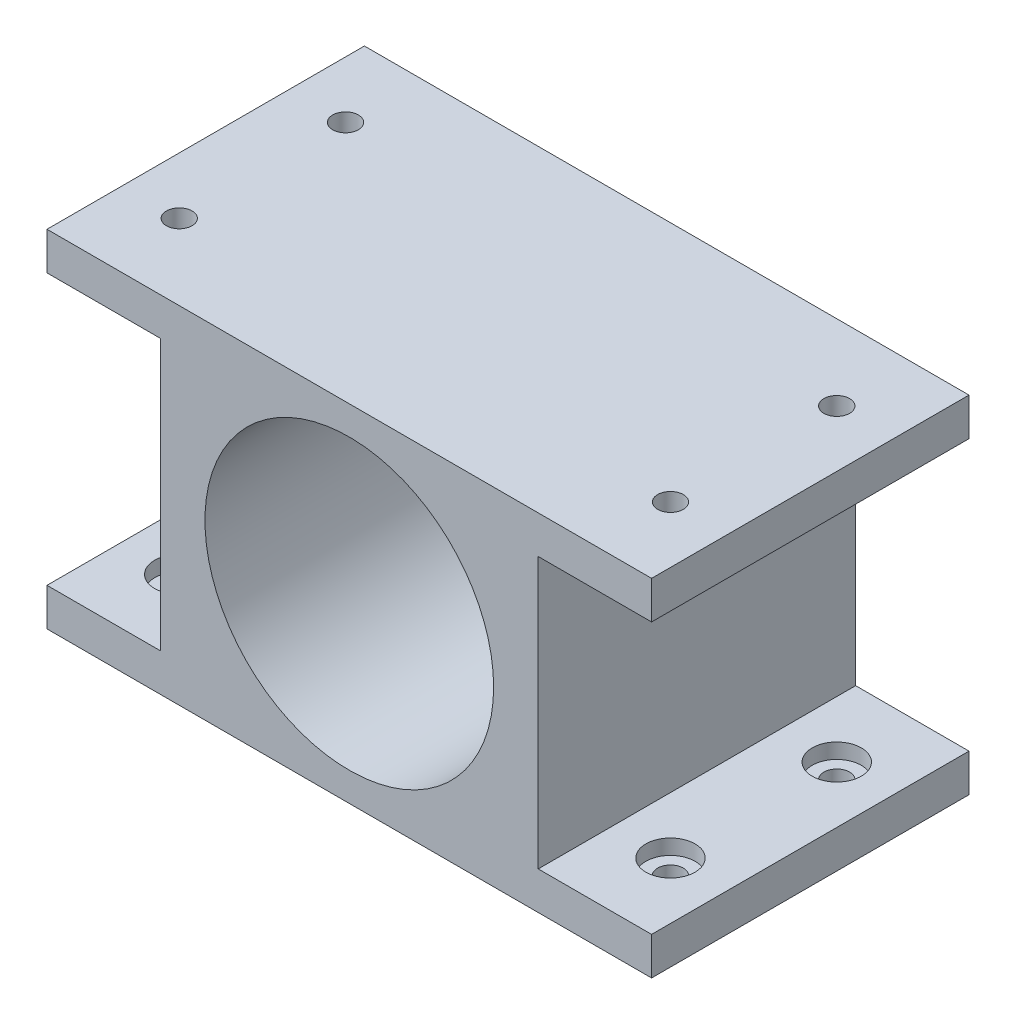
ISO-10303-21;
HEADER;
FILE_DESCRIPTION(('STEP AP214'),'2;1');
FILE_NAME('part.step','',(''),(''),'','','');
FILE_SCHEMA(('AUTOMOTIVE_DESIGN { 1 0 10303 214 1 1 1 1 }'));
ENDSEC;
DATA;
#1=APPLICATION_CONTEXT('core data for automotive mechanical design processes');
#2=APPLICATION_PROTOCOL_DEFINITION('international standard','automotive_design',2000,#1);
#3=PRODUCT_CONTEXT('',#1,'mechanical');
#4=PRODUCT('Part','Part','',(#3));
#5=PRODUCT_RELATED_PRODUCT_CATEGORY('part','',(#4));
#6=PRODUCT_DEFINITION_FORMATION('','',#4);
#7=PRODUCT_DEFINITION_CONTEXT('part definition',#1,'design');
#8=PRODUCT_DEFINITION('design','',#6,#7);
#9=PRODUCT_DEFINITION_SHAPE('','',#8);
#10=(LENGTH_UNIT() NAMED_UNIT(*) SI_UNIT(.MILLI.,.METRE.));
#11=(NAMED_UNIT(*) PLANE_ANGLE_UNIT() SI_UNIT($,.RADIAN.));
#12=(NAMED_UNIT(*) SI_UNIT($,.STERADIAN.) SOLID_ANGLE_UNIT());
#13=UNCERTAINTY_MEASURE_WITH_UNIT(LENGTH_MEASURE(1.E-05),#10,'distance_accuracy_value','');
#14=(GEOMETRIC_REPRESENTATION_CONTEXT(3) GLOBAL_UNCERTAINTY_ASSIGNED_CONTEXT((#13)) GLOBAL_UNIT_ASSIGNED_CONTEXT((#10,
#11,#12)) REPRESENTATION_CONTEXT('',''));
#15=CARTESIAN_POINT('',(0.,0.,0.));
#16=DIRECTION('',(0.,0.,1.));
#17=DIRECTION('',(1.,0.,0.));
#18=AXIS2_PLACEMENT_3D('',#15,#16,#17);
#19=CARTESIAN_POINT('',(0.,0.,2.));
#20=DIRECTION('',(0.,0.,1.));
#21=DIRECTION('',(1.,0.,0.));
#22=AXIS2_PLACEMENT_3D('',#19,#20,#21);
#23=PLANE('',#22);
#24=CARTESIAN_POINT('',(25.,38.1,2.));
#25=DIRECTION('',(0.,0.,1.));
#26=DIRECTION('',(1.,0.,0.));
#27=AXIS2_PLACEMENT_3D('',#24,#25,#26);
#28=CIRCLE('',#27,2.);
#29=CARTESIAN_POINT('',(27.,38.1,2.));
#30=VERTEX_POINT('',#29);
#31=EDGE_CURVE('E199',#30,#30,#28,.T.);
#32=ORIENTED_EDGE('',*,*,#31,.F.);
#33=EDGE_LOOP('',(#32));
#34=FACE_BOUND('',#33,.T.);
#35=CARTESIAN_POINT('',(38.1635861375235,15.3,2.));
#36=DIRECTION('',(0.,0.,1.));
#37=DIRECTION('',(1.,0.,0.));
#38=AXIS2_PLACEMENT_3D('',#35,#36,#37);
#39=CIRCLE('',#38,2.);
#40=CARTESIAN_POINT('',(40.1635861375235,15.3,2.));
#41=VERTEX_POINT('',#40);
#42=EDGE_CURVE('E196',#41,#41,#39,.T.);
#43=ORIENTED_EDGE('',*,*,#42,.F.);
#44=EDGE_LOOP('',(#43));
#45=FACE_BOUND('',#44,.T.);
#46=CARTESIAN_POINT('',(11.8364138624766,15.2999999999999,2.));
#47=DIRECTION('',(0.,0.,1.));
#48=DIRECTION('',(1.,0.,0.));
#49=AXIS2_PLACEMENT_3D('',#46,#47,#48);
#50=CIRCLE('',#49,2.);
#51=CARTESIAN_POINT('',(13.8364138624766,15.2999999999999,2.));
#52=VERTEX_POINT('',#51);
#53=EDGE_CURVE('E192',#52,#52,#50,.T.);
#54=ORIENTED_EDGE('',*,*,#53,.F.);
#55=EDGE_LOOP('',(#54));
#56=FACE_BOUND('',#55,.T.);
#57=CARTESIAN_POINT('',(25.,22.9,2.));
#58=DIRECTION('',(0.,0.,1.));
#59=DIRECTION('',(1.,0.,0.));
#60=AXIS2_PLACEMENT_3D('',#57,#58,#59);
#61=CIRCLE('',#60,11.);
#62=CARTESIAN_POINT('',(36.,22.9,2.));
#63=VERTEX_POINT('',#62);
#64=EDGE_CURVE('E189',#63,#63,#61,.T.);
#65=ORIENTED_EDGE('',*,*,#64,.F.);
#66=EDGE_LOOP('',(#65));
#67=FACE_BOUND('',#66,.T.);
#68=CARTESIAN_POINT('',(25.,22.9,2.));
#69=DIRECTION('',(0.,0.,1.));
#70=DIRECTION('',(1.,0.,0.));
#71=AXIS2_PLACEMENT_3D('',#68,#69,#70);
#72=CIRCLE('',#71,19.1);
#73=CARTESIAN_POINT('',(44.1,22.9,2.));
#74=VERTEX_POINT('',#73);
#75=EDGE_CURVE('E11',#74,#74,#72,.F.);
#76=ORIENTED_EDGE('',*,*,#75,.F.);
#77=EDGE_LOOP('',(#76));
#78=FACE_BOUND('',#77,.T.);
#79=ADVANCED_FACE('F35',(#34,#45,#56,#67,#78),#23,.T.);
#80=CARTESIAN_POINT('',(0.,45.8,2.));
#81=DIRECTION('',(0.,-1.,0.));
#82=DIRECTION('',(0.,0.,-1.));
#83=AXIS2_PLACEMENT_3D('',#80,#81,#82);
#84=PLANE('',#83);
#85=CARTESIAN_POINT('',(57.5,45.8,32.));
#86=DIRECTION('',(0.,-1.,0.));
#87=DIRECTION('',(0.,0.,-1.));
#88=AXIS2_PLACEMENT_3D('',#85,#86,#87);
#89=CIRCLE('',#88,1.7);
#90=CARTESIAN_POINT('',(57.5,45.8,30.3));
#91=VERTEX_POINT('',#90);
#92=EDGE_CURVE('E445',#91,#91,#89,.T.);
#93=ORIENTED_EDGE('',*,*,#92,.T.);
#94=EDGE_LOOP('',(#93));
#95=FACE_BOUND('',#94,.T.);
#96=CARTESIAN_POINT('',(57.5,45.8,10.));
#97=DIRECTION('',(0.,-1.,0.));
#98=DIRECTION('',(0.,0.,-1.));
#99=AXIS2_PLACEMENT_3D('',#96,#97,#98);
#100=CIRCLE('',#99,1.7);
#101=CARTESIAN_POINT('',(57.5,45.8,8.3));
#102=VERTEX_POINT('',#101);
#103=EDGE_CURVE('E433',#102,#102,#100,.T.);
#104=ORIENTED_EDGE('',*,*,#103,.T.);
#105=EDGE_LOOP('',(#104));
#106=FACE_BOUND('',#105,.T.);
#107=CARTESIAN_POINT('',(-7.5,45.8,10.));
#108=DIRECTION('',(0.,-1.,0.));
#109=DIRECTION('',(0.,0.,-1.));
#110=AXIS2_PLACEMENT_3D('',#107,#108,#109);
#111=CIRCLE('',#110,1.7);
#112=CARTESIAN_POINT('',(-7.5,45.8,8.3));
#113=VERTEX_POINT('',#112);
#114=EDGE_CURVE('E421',#113,#113,#111,.T.);
#115=ORIENTED_EDGE('',*,*,#114,.T.);
#116=EDGE_LOOP('',(#115));
#117=FACE_BOUND('',#116,.T.);
#118=CARTESIAN_POINT('',(-7.5,45.8,32.));
#119=DIRECTION('',(0.,-1.,0.));
#120=DIRECTION('',(0.,0.,-1.));
#121=AXIS2_PLACEMENT_3D('',#118,#119,#120);
#122=CIRCLE('',#121,1.7);
#123=CARTESIAN_POINT('',(-7.5,45.8,30.3));
#124=VERTEX_POINT('',#123);
#125=EDGE_CURVE('E409',#124,#124,#122,.T.);
#126=ORIENTED_EDGE('',*,*,#125,.T.);
#127=EDGE_LOOP('',(#126));
#128=FACE_BOUND('',#127,.T.);
#129=DIRECTION('',(-1.,0.,0.));
#130=VECTOR('',#129,1.);
#131=CARTESIAN_POINT('',(0.,45.8,0.));
#132=LINE('',#131,#130);
#133=CARTESIAN_POINT('',(65.,45.8,0.));
#134=VERTEX_POINT('',#133);
#135=CARTESIAN_POINT('',(-15.,45.8,0.));
#136=VERTEX_POINT('',#135);
#137=EDGE_CURVE('E188',#134,#136,#132,.T.);
#138=ORIENTED_EDGE('',*,*,#137,.T.);
#139=DIRECTION('',(0.,0.,-1.));
#140=VECTOR('',#139,1.);
#141=CARTESIAN_POINT('',(-15.,45.8,2.));
#142=LINE('',#141,#140);
#143=CARTESIAN_POINT('',(-15.,45.8,42.));
#144=VERTEX_POINT('',#143);
#145=EDGE_CURVE('E43',#144,#136,#142,.T.);
#146=ORIENTED_EDGE('',*,*,#145,.F.);
#147=DIRECTION('',(-1.,0.,0.));
#148=VECTOR('',#147,1.);
#149=CARTESIAN_POINT('',(0.,45.8,42.));
#150=LINE('',#149,#148);
#151=CARTESIAN_POINT('',(65.,45.8,42.));
#152=VERTEX_POINT('',#151);
#153=EDGE_CURVE('E164',#152,#144,#150,.T.);
#154=ORIENTED_EDGE('',*,*,#153,.F.);
#155=DIRECTION('',(0.,0.,-1.));
#156=VECTOR('',#155,1.);
#157=CARTESIAN_POINT('',(65.,45.8,2.));
#158=LINE('',#157,#156);
#159=EDGE_CURVE('E50',#152,#134,#158,.T.);
#160=ORIENTED_EDGE('',*,*,#159,.T.);
#161=EDGE_LOOP('',(#138,#146,#154,#160));
#162=FACE_BOUND('',#161,.T.);
#163=ADVANCED_FACE('F37',(#95,#106,#117,#128,#162),#84,.F.);
#164=CARTESIAN_POINT('',(-15.,0.,2.));
#165=DIRECTION('',(1.,0.,0.));
#166=DIRECTION('',(0.,1.,0.));
#167=AXIS2_PLACEMENT_3D('',#164,#165,#166);
#168=PLANE('',#167);
#169=DIRECTION('',(0.,-1.,0.));
#170=VECTOR('',#169,1.);
#171=CARTESIAN_POINT('',(-15.,0.,0.));
#172=LINE('',#171,#170);
#173=CARTESIAN_POINT('',(-15.,40.8,0.));
#174=VERTEX_POINT('',#173);
#175=EDGE_CURVE('E203',#136,#174,#172,.T.);
#176=ORIENTED_EDGE('',*,*,#175,.T.);
#177=DIRECTION('',(0.,0.,-1.));
#178=VECTOR('',#177,1.);
#179=CARTESIAN_POINT('',(-15.,40.8,2.));
#180=LINE('',#179,#178);
#181=CARTESIAN_POINT('',(-15.,40.8,42.));
#182=VERTEX_POINT('',#181);
#183=EDGE_CURVE('E257',#182,#174,#180,.T.);
#184=ORIENTED_EDGE('',*,*,#183,.F.);
#185=DIRECTION('',(0.,-1.,0.));
#186=VECTOR('',#185,1.);
#187=CARTESIAN_POINT('',(-15.,0.,42.));
#188=LINE('',#187,#186);
#189=EDGE_CURVE('E167',#144,#182,#188,.T.);
#190=ORIENTED_EDGE('',*,*,#189,.F.);
#191=ORIENTED_EDGE('',*,*,#145,.T.);
#192=EDGE_LOOP('',(#176,#184,#190,#191));
#193=FACE_BOUND('',#192,.T.);
#194=ADVANCED_FACE('F261',(#193),#168,.F.);
#195=CARTESIAN_POINT('',(0.,40.8,2.));
#196=DIRECTION('',(0.,-1.,0.));
#197=DIRECTION('',(0.,0.,-1.));
#198=AXIS2_PLACEMENT_3D('',#195,#196,#197);
#199=PLANE('',#198);
#200=CARTESIAN_POINT('',(-7.5,40.8,10.));
#201=DIRECTION('',(0.,-1.,0.));
#202=DIRECTION('',(0.,0.,-1.));
#203=AXIS2_PLACEMENT_3D('',#200,#201,#202);
#204=CIRCLE('',#203,3.25);
#205=CARTESIAN_POINT('',(-7.5,40.8,6.75));
#206=VERTEX_POINT('',#205);
#207=EDGE_CURVE('E430',#206,#206,#204,.T.);
#208=ORIENTED_EDGE('',*,*,#207,.F.);
#209=EDGE_LOOP('',(#208));
#210=FACE_BOUND('',#209,.T.);
#211=CARTESIAN_POINT('',(-7.5,40.8,32.));
#212=DIRECTION('',(0.,-1.,0.));
#213=DIRECTION('',(0.,0.,-1.));
#214=AXIS2_PLACEMENT_3D('',#211,#212,#213);
#215=CIRCLE('',#214,3.25);
#216=CARTESIAN_POINT('',(-7.5,40.8,28.75));
#217=VERTEX_POINT('',#216);
#218=EDGE_CURVE('E418',#217,#217,#215,.T.);
#219=ORIENTED_EDGE('',*,*,#218,.F.);
#220=EDGE_LOOP('',(#219));
#221=FACE_BOUND('',#220,.T.);
#222=DIRECTION('',(-1.,0.,0.));
#223=VECTOR('',#222,1.);
#224=CARTESIAN_POINT('',(0.,40.8,0.));
#225=LINE('',#224,#223);
#226=CARTESIAN_POINT('',(0.,40.8,0.));
#227=VERTEX_POINT('',#226);
#228=EDGE_CURVE('E206',#227,#174,#225,.T.);
#229=ORIENTED_EDGE('',*,*,#228,.F.);
#230=DIRECTION('',(0.,0.,-1.));
#231=VECTOR('',#230,1.);
#232=CARTESIAN_POINT('',(0.,40.8,2.));
#233=LINE('',#232,#231);
#234=CARTESIAN_POINT('',(0.,40.8,42.));
#235=VERTEX_POINT('',#234);
#236=EDGE_CURVE('E255',#235,#227,#233,.T.);
#237=ORIENTED_EDGE('',*,*,#236,.F.);
#238=DIRECTION('',(1.,0.,0.));
#239=VECTOR('',#238,1.);
#240=CARTESIAN_POINT('',(0.,40.8,42.));
#241=LINE('',#240,#239);
#242=EDGE_CURVE('E170',#182,#235,#241,.T.);
#243=ORIENTED_EDGE('',*,*,#242,.F.);
#244=ORIENTED_EDGE('',*,*,#183,.T.);
#245=EDGE_LOOP('',(#229,#237,#243,#244));
#246=FACE_BOUND('',#245,.T.);
#247=ADVANCED_FACE('F290',(#210,#221,#246),#199,.T.);
#248=CARTESIAN_POINT('',(0.,0.,2.));
#249=DIRECTION('',(-1.,0.,0.));
#250=DIRECTION('',(0.,0.,1.));
#251=AXIS2_PLACEMENT_3D('',#248,#249,#250);
#252=PLANE('',#251);
#253=DIRECTION('',(0.,1.,0.));
#254=VECTOR('',#253,1.);
#255=CARTESIAN_POINT('',(0.,0.,0.));
#256=LINE('',#255,#254);
#257=CARTESIAN_POINT('',(0.,5.,0.));
#258=VERTEX_POINT('',#257);
#259=EDGE_CURVE('E209',#258,#227,#256,.T.);
#260=ORIENTED_EDGE('',*,*,#259,.F.);
#261=DIRECTION('',(0.,0.,-1.));
#262=VECTOR('',#261,1.);
#263=CARTESIAN_POINT('',(0.,5.,2.));
#264=LINE('',#263,#262);
#265=CARTESIAN_POINT('',(0.,5.,42.));
#266=VERTEX_POINT('',#265);
#267=EDGE_CURVE('E253',#266,#258,#264,.T.);
#268=ORIENTED_EDGE('',*,*,#267,.F.);
#269=DIRECTION('',(0.,-1.,0.));
#270=VECTOR('',#269,1.);
#271=CARTESIAN_POINT('',(0.,0.,42.));
#272=LINE('',#271,#270);
#273=EDGE_CURVE('E173',#235,#266,#272,.T.);
#274=ORIENTED_EDGE('',*,*,#273,.F.);
#275=ORIENTED_EDGE('',*,*,#236,.T.);
#276=EDGE_LOOP('',(#260,#268,#274,#275));
#277=FACE_BOUND('',#276,.T.);
#278=ADVANCED_FACE('F285',(#277),#252,.T.);
#279=CARTESIAN_POINT('',(0.,5.,2.));
#280=DIRECTION('',(0.,-1.,0.));
#281=DIRECTION('',(1.,0.,0.));
#282=AXIS2_PLACEMENT_3D('',#279,#280,#281);
#283=PLANE('',#282);
#284=CARTESIAN_POINT('',(-7.5,5.,10.));
#285=DIRECTION('',(0.,1.,0.));
#286=DIRECTION('',(0.,0.,1.));
#287=AXIS2_PLACEMENT_3D('',#284,#285,#286);
#288=CIRCLE('',#287,3.25);
#289=CARTESIAN_POINT('',(-7.5,5.,13.25));
#290=VERTEX_POINT('',#289);
#291=EDGE_CURVE('E386',#290,#290,#288,.T.);
#292=ORIENTED_EDGE('',*,*,#291,.F.);
#293=EDGE_LOOP('',(#292));
#294=FACE_BOUND('',#293,.T.);
#295=CARTESIAN_POINT('',(-7.5,5.,32.));
#296=DIRECTION('',(0.,1.,0.));
#297=DIRECTION('',(0.,0.,1.));
#298=AXIS2_PLACEMENT_3D('',#295,#296,#297);
#299=CIRCLE('',#298,3.25);
#300=CARTESIAN_POINT('',(-7.5,5.,35.25));
#301=VERTEX_POINT('',#300);
#302=EDGE_CURVE('E374',#301,#301,#299,.T.);
#303=ORIENTED_EDGE('',*,*,#302,.F.);
#304=EDGE_LOOP('',(#303));
#305=FACE_BOUND('',#304,.T.);
#306=DIRECTION('',(-1.,0.,0.));
#307=VECTOR('',#306,1.);
#308=CARTESIAN_POINT('',(0.,5.,0.));
#309=LINE('',#308,#307);
#310=CARTESIAN_POINT('',(-15.,5.,0.));
#311=VERTEX_POINT('',#310);
#312=EDGE_CURVE('E212',#258,#311,#309,.T.);
#313=ORIENTED_EDGE('',*,*,#312,.T.);
#314=DIRECTION('',(0.,0.,-1.));
#315=VECTOR('',#314,1.);
#316=CARTESIAN_POINT('',(-15.,5.,2.));
#317=LINE('',#316,#315);
#318=CARTESIAN_POINT('',(-15.,5.,42.));
#319=VERTEX_POINT('',#318);
#320=EDGE_CURVE('E251',#319,#311,#317,.T.);
#321=ORIENTED_EDGE('',*,*,#320,.F.);
#322=DIRECTION('',(-1.,0.,0.));
#323=VECTOR('',#322,1.);
#324=CARTESIAN_POINT('',(0.,5.,42.));
#325=LINE('',#324,#323);
#326=EDGE_CURVE('E176',#266,#319,#325,.T.);
#327=ORIENTED_EDGE('',*,*,#326,.F.);
#328=ORIENTED_EDGE('',*,*,#267,.T.);
#329=EDGE_LOOP('',(#313,#321,#327,#328));
#330=FACE_BOUND('',#329,.T.);
#331=ADVANCED_FACE('F291',(#294,#305,#330),#283,.F.);
#332=CARTESIAN_POINT('',(-15.,0.,2.));
#333=DIRECTION('',(-1.,0.,0.));
#334=DIRECTION('',(0.,0.,1.));
#335=AXIS2_PLACEMENT_3D('',#332,#333,#334);
#336=PLANE('',#335);
#337=DIRECTION('',(0.,1.,0.));
#338=VECTOR('',#337,1.);
#339=CARTESIAN_POINT('',(-15.,0.,0.));
#340=LINE('',#339,#338);
#341=CARTESIAN_POINT('',(-15.,0.,0.));
#342=VERTEX_POINT('',#341);
#343=EDGE_CURVE('E215',#342,#311,#340,.T.);
#344=ORIENTED_EDGE('',*,*,#343,.F.);
#345=DIRECTION('',(0.,0.,-1.));
#346=VECTOR('',#345,1.);
#347=CARTESIAN_POINT('',(-15.,0.,2.));
#348=LINE('',#347,#346);
#349=CARTESIAN_POINT('',(-15.,0.,42.));
#350=VERTEX_POINT('',#349);
#351=EDGE_CURVE('E249',#350,#342,#348,.T.);
#352=ORIENTED_EDGE('',*,*,#351,.F.);
#353=DIRECTION('',(0.,-1.,0.));
#354=VECTOR('',#353,1.);
#355=CARTESIAN_POINT('',(-15.,0.,42.));
#356=LINE('',#355,#354);
#357=EDGE_CURVE('E179',#319,#350,#356,.T.);
#358=ORIENTED_EDGE('',*,*,#357,.F.);
#359=ORIENTED_EDGE('',*,*,#320,.T.);
#360=EDGE_LOOP('',(#344,#352,#358,#359));
#361=FACE_BOUND('',#360,.T.);
#362=ADVANCED_FACE('F280',(#361),#336,.T.);
#363=CARTESIAN_POINT('',(0.,0.,2.));
#364=DIRECTION('',(0.,1.,0.));
#365=DIRECTION('',(0.,0.,1.));
#366=AXIS2_PLACEMENT_3D('',#363,#364,#365);
#367=PLANE('',#366);
#368=CARTESIAN_POINT('',(57.5,0.,32.));
#369=DIRECTION('',(0.,1.,0.));
#370=DIRECTION('',(0.,0.,1.));
#371=AXIS2_PLACEMENT_3D('',#368,#369,#370);
#372=CIRCLE('',#371,1.7);
#373=CARTESIAN_POINT('',(57.5,0.,33.7));
#374=VERTEX_POINT('',#373);
#375=EDGE_CURVE('E353',#374,#374,#372,.T.);
#376=ORIENTED_EDGE('',*,*,#375,.T.);
#377=EDGE_LOOP('',(#376));
#378=FACE_BOUND('',#377,.T.);
#379=CARTESIAN_POINT('',(57.5,0.,10.));
#380=DIRECTION('',(0.,1.,0.));
#381=DIRECTION('',(0.,0.,1.));
#382=AXIS2_PLACEMENT_3D('',#379,#380,#381);
#383=CIRCLE('',#382,1.7);
#384=CARTESIAN_POINT('',(57.5,0.,11.7));
#385=VERTEX_POINT('',#384);
#386=EDGE_CURVE('E357',#385,#385,#383,.T.);
#387=ORIENTED_EDGE('',*,*,#386,.T.);
#388=EDGE_LOOP('',(#387));
#389=FACE_BOUND('',#388,.T.);
#390=CARTESIAN_POINT('',(-7.5,0.,10.));
#391=DIRECTION('',(0.,1.,0.));
#392=DIRECTION('',(0.,0.,1.));
#393=AXIS2_PLACEMENT_3D('',#390,#391,#392);
#394=CIRCLE('',#393,1.7);
#395=CARTESIAN_POINT('',(-7.5,0.,11.7));
#396=VERTEX_POINT('',#395);
#397=EDGE_CURVE('E361',#396,#396,#394,.T.);
#398=ORIENTED_EDGE('',*,*,#397,.T.);
#399=EDGE_LOOP('',(#398));
#400=FACE_BOUND('',#399,.T.);
#401=CARTESIAN_POINT('',(-7.5,0.,32.));
#402=DIRECTION('',(0.,1.,0.));
#403=DIRECTION('',(0.,0.,1.));
#404=AXIS2_PLACEMENT_3D('',#401,#402,#403);
#405=CIRCLE('',#404,1.7);
#406=CARTESIAN_POINT('',(-7.5,0.,33.7));
#407=VERTEX_POINT('',#406);
#408=EDGE_CURVE('E153',#407,#407,#405,.T.);
#409=ORIENTED_EDGE('',*,*,#408,.T.);
#410=EDGE_LOOP('',(#409));
#411=FACE_BOUND('',#410,.T.);
#412=DIRECTION('',(1.,0.,0.));
#413=VECTOR('',#412,1.);
#414=CARTESIAN_POINT('',(0.,0.,0.));
#415=LINE('',#414,#413);
#416=CARTESIAN_POINT('',(65.,0.,0.));
#417=VERTEX_POINT('',#416);
#418=EDGE_CURVE('E218',#342,#417,#415,.T.);
#419=ORIENTED_EDGE('',*,*,#418,.T.);
#420=DIRECTION('',(0.,0.,-1.));
#421=VECTOR('',#420,1.);
#422=CARTESIAN_POINT('',(65.,0.,2.));
#423=LINE('',#422,#421);
#424=CARTESIAN_POINT('',(65.,0.,42.));
#425=VERTEX_POINT('',#424);
#426=EDGE_CURVE('E246',#425,#417,#423,.T.);
#427=ORIENTED_EDGE('',*,*,#426,.F.);
#428=DIRECTION('',(1.,0.,0.));
#429=VECTOR('',#428,1.);
#430=CARTESIAN_POINT('',(0.,0.,42.));
#431=LINE('',#430,#429);
#432=EDGE_CURVE('E182',#350,#425,#431,.T.);
#433=ORIENTED_EDGE('',*,*,#432,.F.);
#434=ORIENTED_EDGE('',*,*,#351,.T.);
#435=EDGE_LOOP('',(#419,#427,#433,#434));
#436=FACE_BOUND('',#435,.T.);
#437=ADVANCED_FACE('F276',(#378,#389,#400,#411,#436),#367,.F.);
#438=CARTESIAN_POINT('',(65.,0.,2.));
#439=DIRECTION('',(-1.,0.,0.));
#440=DIRECTION('',(0.,0.,1.));
#441=AXIS2_PLACEMENT_3D('',#438,#439,#440);
#442=PLANE('',#441);
#443=DIRECTION('',(0.,1.,0.));
#444=VECTOR('',#443,1.);
#445=CARTESIAN_POINT('',(65.,0.,0.));
#446=LINE('',#445,#444);
#447=CARTESIAN_POINT('',(65.,5.,0.));
#448=VERTEX_POINT('',#447);
#449=EDGE_CURVE('E220',#417,#448,#446,.T.);
#450=ORIENTED_EDGE('',*,*,#449,.T.);
#451=DIRECTION('',(0.,0.,-1.));
#452=VECTOR('',#451,1.);
#453=CARTESIAN_POINT('',(65.,5.,2.));
#454=LINE('',#453,#452);
#455=CARTESIAN_POINT('',(65.,5.,42.));
#456=VERTEX_POINT('',#455);
#457=EDGE_CURVE('E135',#456,#448,#454,.T.);
#458=ORIENTED_EDGE('',*,*,#457,.F.);
#459=DIRECTION('',(0.,1.,0.));
#460=VECTOR('',#459,1.);
#461=CARTESIAN_POINT('',(65.,0.,42.));
#462=LINE('',#461,#460);
#463=EDGE_CURVE('E152',#425,#456,#462,.T.);
#464=ORIENTED_EDGE('',*,*,#463,.F.);
#465=ORIENTED_EDGE('',*,*,#426,.T.);
#466=EDGE_LOOP('',(#450,#458,#464,#465));
#467=FACE_BOUND('',#466,.T.);
#468=ADVANCED_FACE('F273',(#467),#442,.F.);
#469=CARTESIAN_POINT('',(0.,5.,2.));
#470=DIRECTION('',(0.,1.,0.));
#471=DIRECTION('',(0.,0.,1.));
#472=AXIS2_PLACEMENT_3D('',#469,#470,#471);
#473=PLANE('',#472);
#474=CARTESIAN_POINT('',(57.5,5.,32.));
#475=DIRECTION('',(0.,1.,0.));
#476=DIRECTION('',(0.,0.,1.));
#477=AXIS2_PLACEMENT_3D('',#474,#475,#476);
#478=CIRCLE('',#477,3.25);
#479=CARTESIAN_POINT('',(57.5,5.,35.25));
#480=VERTEX_POINT('',#479);
#481=EDGE_CURVE('E406',#480,#480,#478,.T.);
#482=ORIENTED_EDGE('',*,*,#481,.F.);
#483=EDGE_LOOP('',(#482));
#484=FACE_BOUND('',#483,.T.);
#485=CARTESIAN_POINT('',(57.5,5.,10.));
#486=DIRECTION('',(0.,1.,0.));
#487=DIRECTION('',(0.,0.,1.));
#488=AXIS2_PLACEMENT_3D('',#485,#486,#487);
#489=CIRCLE('',#488,3.25);
#490=CARTESIAN_POINT('',(57.5,5.,13.25));
#491=VERTEX_POINT('',#490);
#492=EDGE_CURVE('E396',#491,#491,#489,.T.);
#493=ORIENTED_EDGE('',*,*,#492,.F.);
#494=EDGE_LOOP('',(#493));
#495=FACE_BOUND('',#494,.T.);
#496=DIRECTION('',(1.,0.,0.));
#497=VECTOR('',#496,1.);
#498=CARTESIAN_POINT('',(0.,5.,0.));
#499=LINE('',#498,#497);
#500=CARTESIAN_POINT('',(50.,5.,0.));
#501=VERTEX_POINT('',#500);
#502=EDGE_CURVE('E132',#501,#448,#499,.T.);
#503=ORIENTED_EDGE('',*,*,#502,.F.);
#504=DIRECTION('',(0.,0.,-1.));
#505=VECTOR('',#504,1.);
#506=CARTESIAN_POINT('',(50.,5.,2.));
#507=LINE('',#506,#505);
#508=CARTESIAN_POINT('',(50.,5.,42.));
#509=VERTEX_POINT('',#508);
#510=EDGE_CURVE('E126',#509,#501,#507,.T.);
#511=ORIENTED_EDGE('',*,*,#510,.F.);
#512=DIRECTION('',(-1.,0.,0.));
#513=VECTOR('',#512,1.);
#514=CARTESIAN_POINT('',(0.,5.,42.));
#515=LINE('',#514,#513);
#516=EDGE_CURVE('E130',#456,#509,#515,.T.);
#517=ORIENTED_EDGE('',*,*,#516,.F.);
#518=ORIENTED_EDGE('',*,*,#457,.T.);
#519=EDGE_LOOP('',(#503,#511,#517,#518));
#520=FACE_BOUND('',#519,.T.);
#521=ADVANCED_FACE('F128',(#484,#495,#520),#473,.T.);
#522=CARTESIAN_POINT('',(50.,0.,2.));
#523=DIRECTION('',(-1.,0.,0.));
#524=DIRECTION('',(0.,0.,1.));
#525=AXIS2_PLACEMENT_3D('',#522,#523,#524);
#526=PLANE('',#525);
#527=DIRECTION('',(0.,1.,0.));
#528=VECTOR('',#527,1.);
#529=CARTESIAN_POINT('',(50.,0.,0.));
#530=LINE('',#529,#528);
#531=CARTESIAN_POINT('',(50.,40.8,0.));
#532=VERTEX_POINT('',#531);
#533=EDGE_CURVE('E224',#501,#532,#530,.T.);
#534=ORIENTED_EDGE('',*,*,#533,.T.);
#535=DIRECTION('',(0.,0.,-1.));
#536=VECTOR('',#535,1.);
#537=CARTESIAN_POINT('',(50.,40.8,2.));
#538=LINE('',#537,#536);
#539=CARTESIAN_POINT('',(50.,40.8,42.));
#540=VERTEX_POINT('',#539);
#541=EDGE_CURVE('E136',#540,#532,#538,.T.);
#542=ORIENTED_EDGE('',*,*,#541,.F.);
#543=DIRECTION('',(0.,1.,0.));
#544=VECTOR('',#543,1.);
#545=CARTESIAN_POINT('',(50.,0.,42.));
#546=LINE('',#545,#544);
#547=EDGE_CURVE('E139',#509,#540,#546,.T.);
#548=ORIENTED_EDGE('',*,*,#547,.F.);
#549=ORIENTED_EDGE('',*,*,#510,.T.);
#550=EDGE_LOOP('',(#534,#542,#548,#549));
#551=FACE_BOUND('',#550,.T.);
#552=ADVANCED_FACE('F140',(#551),#526,.F.);
#553=CARTESIAN_POINT('',(0.,40.8,2.));
#554=DIRECTION('',(0.,1.,0.));
#555=DIRECTION('',(0.,0.,1.));
#556=AXIS2_PLACEMENT_3D('',#553,#554,#555);
#557=PLANE('',#556);
#558=CARTESIAN_POINT('',(57.5,40.8,32.));
#559=DIRECTION('',(0.,-1.,0.));
#560=DIRECTION('',(0.,0.,-1.));
#561=AXIS2_PLACEMENT_3D('',#558,#559,#560);
#562=CIRCLE('',#561,3.25);
#563=CARTESIAN_POINT('',(57.5,40.8,28.75));
#564=VERTEX_POINT('',#563);
#565=EDGE_CURVE('E454',#564,#564,#562,.T.);
#566=ORIENTED_EDGE('',*,*,#565,.F.);
#567=EDGE_LOOP('',(#566));
#568=FACE_BOUND('',#567,.T.);
#569=CARTESIAN_POINT('',(57.5,40.8,10.));
#570=DIRECTION('',(0.,-1.,0.));
#571=DIRECTION('',(0.,0.,-1.));
#572=AXIS2_PLACEMENT_3D('',#569,#570,#571);
#573=CIRCLE('',#572,3.25);
#574=CARTESIAN_POINT('',(57.5,40.8,6.75000000000001));
#575=VERTEX_POINT('',#574);
#576=EDGE_CURVE('E442',#575,#575,#573,.T.);
#577=ORIENTED_EDGE('',*,*,#576,.F.);
#578=EDGE_LOOP('',(#577));
#579=FACE_BOUND('',#578,.T.);
#580=DIRECTION('',(1.,0.,0.));
#581=VECTOR('',#580,1.);
#582=CARTESIAN_POINT('',(0.,40.8,0.));
#583=LINE('',#582,#581);
#584=CARTESIAN_POINT('',(65.,40.8,0.));
#585=VERTEX_POINT('',#584);
#586=EDGE_CURVE('E226',#532,#585,#583,.T.);
#587=ORIENTED_EDGE('',*,*,#586,.T.);
#588=DIRECTION('',(0.,0.,-1.));
#589=VECTOR('',#588,1.);
#590=CARTESIAN_POINT('',(65.,40.8,2.));
#591=LINE('',#590,#589);
#592=CARTESIAN_POINT('',(65.,40.8,42.));
#593=VERTEX_POINT('',#592);
#594=EDGE_CURVE('E58',#593,#585,#591,.T.);
#595=ORIENTED_EDGE('',*,*,#594,.F.);
#596=DIRECTION('',(1.,0.,0.));
#597=VECTOR('',#596,1.);
#598=CARTESIAN_POINT('',(0.,40.8,42.));
#599=LINE('',#598,#597);
#600=EDGE_CURVE('E145',#540,#593,#599,.T.);
#601=ORIENTED_EDGE('',*,*,#600,.F.);
#602=ORIENTED_EDGE('',*,*,#541,.T.);
#603=EDGE_LOOP('',(#587,#595,#601,#602));
#604=FACE_BOUND('',#603,.T.);
#605=ADVANCED_FACE('F268',(#568,#579,#604),#557,.F.);
#606=CARTESIAN_POINT('',(38.1635861375235,15.3,2.));
#607=DIRECTION('',(0.,0.,-1.));
#608=DIRECTION('',(-1.,0.,0.));
#609=AXIS2_PLACEMENT_3D('',#606,#607,#608);
#610=CYLINDRICAL_SURFACE('',#609,2.);
#611=ORIENTED_EDGE('',*,*,#42,.T.);
#612=EDGE_LOOP('',(#611));
#613=FACE_BOUND('',#612,.T.);
#614=CARTESIAN_POINT('',(38.1635861375235,15.3,0.));
#615=DIRECTION('',(0.,0.,1.));
#616=DIRECTION('',(1.,0.,0.));
#617=AXIS2_PLACEMENT_3D('',#614,#615,#616);
#618=CIRCLE('',#617,2.);
#619=CARTESIAN_POINT('',(40.1635861375235,15.3,0.));
#620=VERTEX_POINT('',#619);
#621=EDGE_CURVE('E237',#620,#620,#618,.T.);
#622=ORIENTED_EDGE('',*,*,#621,.F.);
#623=EDGE_LOOP('',(#622));
#624=FACE_BOUND('',#623,.T.);
#625=ADVANCED_FACE('F322',(#613,#624),#610,.F.);
#626=CARTESIAN_POINT('',(11.8364138624766,15.2999999999999,2.));
#627=DIRECTION('',(0.,0.,-1.));
#628=DIRECTION('',(-1.,0.,0.));
#629=AXIS2_PLACEMENT_3D('',#626,#627,#628);
#630=CYLINDRICAL_SURFACE('',#629,2.);
#631=ORIENTED_EDGE('',*,*,#53,.T.);
#632=EDGE_LOOP('',(#631));
#633=FACE_BOUND('',#632,.T.);
#634=CARTESIAN_POINT('',(11.8364138624766,15.2999999999999,0.));
#635=DIRECTION('',(0.,0.,1.));
#636=DIRECTION('',(1.,0.,0.));
#637=AXIS2_PLACEMENT_3D('',#634,#635,#636);
#638=CIRCLE('',#637,2.);
#639=CARTESIAN_POINT('',(13.8364138624766,15.2999999999999,0.));
#640=VERTEX_POINT('',#639);
#641=EDGE_CURVE('E234',#640,#640,#638,.T.);
#642=ORIENTED_EDGE('',*,*,#641,.F.);
#643=EDGE_LOOP('',(#642));
#644=FACE_BOUND('',#643,.T.);
#645=ADVANCED_FACE('F325',(#633,#644),#630,.F.);
#646=CARTESIAN_POINT('',(25.,22.9,2.));
#647=DIRECTION('',(0.,0.,-1.));
#648=DIRECTION('',(-1.,0.,0.));
#649=AXIS2_PLACEMENT_3D('',#646,#647,#648);
#650=CYLINDRICAL_SURFACE('',#649,11.);
#651=ORIENTED_EDGE('',*,*,#64,.T.);
#652=EDGE_LOOP('',(#651));
#653=FACE_BOUND('',#652,.T.);
#654=CARTESIAN_POINT('',(25.,22.9,0.));
#655=DIRECTION('',(0.,0.,1.));
#656=DIRECTION('',(1.,0.,0.));
#657=AXIS2_PLACEMENT_3D('',#654,#655,#656);
#658=CIRCLE('',#657,11.);
#659=CARTESIAN_POINT('',(36.,22.9,0.));
#660=VERTEX_POINT('',#659);
#661=EDGE_CURVE('E231',#660,#660,#658,.T.);
#662=ORIENTED_EDGE('',*,*,#661,.F.);
#663=EDGE_LOOP('',(#662));
#664=FACE_BOUND('',#663,.T.);
#665=ADVANCED_FACE('F329',(#653,#664),#650,.F.);
#666=CARTESIAN_POINT('',(65.,0.,2.));
#667=DIRECTION('',(1.,0.,0.));
#668=DIRECTION('',(0.,0.,-1.));
#669=AXIS2_PLACEMENT_3D('',#666,#667,#668);
#670=PLANE('',#669);
#671=DIRECTION('',(0.,-1.,0.));
#672=VECTOR('',#671,1.);
#673=CARTESIAN_POINT('',(65.,0.,0.));
#674=LINE('',#673,#672);
#675=EDGE_CURVE('E228',#134,#585,#674,.T.);
#676=ORIENTED_EDGE('',*,*,#675,.F.);
#677=ORIENTED_EDGE('',*,*,#159,.F.);
#678=DIRECTION('',(0.,1.,0.));
#679=VECTOR('',#678,1.);
#680=CARTESIAN_POINT('',(65.,0.,42.));
#681=LINE('',#680,#679);
#682=EDGE_CURVE('E161',#593,#152,#681,.T.);
#683=ORIENTED_EDGE('',*,*,#682,.F.);
#684=ORIENTED_EDGE('',*,*,#594,.T.);
#685=EDGE_LOOP('',(#676,#677,#683,#684));
#686=FACE_BOUND('',#685,.T.);
#687=ADVANCED_FACE('F266',(#686),#670,.T.);
#688=CARTESIAN_POINT('',(25.,38.1,2.));
#689=DIRECTION('',(0.,0.,-1.));
#690=DIRECTION('',(-1.,0.,0.));
#691=AXIS2_PLACEMENT_3D('',#688,#689,#690);
#692=CYLINDRICAL_SURFACE('',#691,2.);
#693=ORIENTED_EDGE('',*,*,#31,.T.);
#694=EDGE_LOOP('',(#693));
#695=FACE_BOUND('',#694,.T.);
#696=CARTESIAN_POINT('',(25.,38.1,0.));
#697=DIRECTION('',(0.,0.,1.));
#698=DIRECTION('',(1.,0.,0.));
#699=AXIS2_PLACEMENT_3D('',#696,#697,#698);
#700=CIRCLE('',#699,2.);
#701=CARTESIAN_POINT('',(27.,38.1,0.));
#702=VERTEX_POINT('',#701);
#703=EDGE_CURVE('E193',#702,#702,#700,.T.);
#704=ORIENTED_EDGE('',*,*,#703,.F.);
#705=EDGE_LOOP('',(#704));
#706=FACE_BOUND('',#705,.T.);
#707=ADVANCED_FACE('F318',(#695,#706),#692,.F.);
#708=CARTESIAN_POINT('',(0.,0.,0.));
#709=DIRECTION('',(0.,0.,1.));
#710=DIRECTION('',(1.,0.,0.));
#711=AXIS2_PLACEMENT_3D('',#708,#709,#710);
#712=PLANE('',#711);
#713=ORIENTED_EDGE('',*,*,#137,.F.);
#714=ORIENTED_EDGE('',*,*,#675,.T.);
#715=ORIENTED_EDGE('',*,*,#586,.F.);
#716=ORIENTED_EDGE('',*,*,#533,.F.);
#717=ORIENTED_EDGE('',*,*,#502,.T.);
#718=ORIENTED_EDGE('',*,*,#449,.F.);
#719=ORIENTED_EDGE('',*,*,#418,.F.);
#720=ORIENTED_EDGE('',*,*,#343,.T.);
#721=ORIENTED_EDGE('',*,*,#312,.F.);
#722=ORIENTED_EDGE('',*,*,#259,.T.);
#723=ORIENTED_EDGE('',*,*,#228,.T.);
#724=ORIENTED_EDGE('',*,*,#175,.F.);
#725=EDGE_LOOP('',(#713,#714,#715,#716,#717,#718,#719,#720,#721,#722,#723,#724));
#726=FACE_BOUND('',#725,.T.);
#727=ORIENTED_EDGE('',*,*,#661,.T.);
#728=EDGE_LOOP('',(#727));
#729=FACE_BOUND('',#728,.T.);
#730=ORIENTED_EDGE('',*,*,#641,.T.);
#731=EDGE_LOOP('',(#730));
#732=FACE_BOUND('',#731,.T.);
#733=ORIENTED_EDGE('',*,*,#621,.T.);
#734=EDGE_LOOP('',(#733));
#735=FACE_BOUND('',#734,.T.);
#736=ORIENTED_EDGE('',*,*,#703,.T.);
#737=EDGE_LOOP('',(#736));
#738=FACE_BOUND('',#737,.T.);
#739=ADVANCED_FACE('F263',(#726,#729,#732,#735,#738),#712,.F.);
#740=CARTESIAN_POINT('',(25.,22.9,42.));
#741=DIRECTION('',(0.,0.,-1.));
#742=DIRECTION('',(-1.,0.,0.));
#743=AXIS2_PLACEMENT_3D('',#740,#741,#742);
#744=CYLINDRICAL_SURFACE('',#743,19.1);
#745=CARTESIAN_POINT('',(25.,22.9,42.));
#746=DIRECTION('',(0.,0.,1.));
#747=DIRECTION('',(1.,0.,0.));
#748=AXIS2_PLACEMENT_3D('',#745,#746,#747);
#749=CIRCLE('',#748,19.1);
#750=CARTESIAN_POINT('',(44.1,22.9,42.));
#751=VERTEX_POINT('',#750);
#752=EDGE_CURVE('E185',#751,#751,#749,.T.);
#753=ORIENTED_EDGE('',*,*,#752,.T.);
#754=EDGE_LOOP('',(#753));
#755=FACE_BOUND('',#754,.T.);
#756=ORIENTED_EDGE('',*,*,#75,.T.);
#757=EDGE_LOOP('',(#756));
#758=FACE_BOUND('',#757,.T.);
#759=ADVANCED_FACE('F314',(#755,#758),#744,.F.);
#760=CARTESIAN_POINT('',(0.,0.,42.));
#761=DIRECTION('',(0.,0.,1.));
#762=DIRECTION('',(1.,0.,0.));
#763=AXIS2_PLACEMENT_3D('',#760,#761,#762);
#764=PLANE('',#763);
#765=ORIENTED_EDGE('',*,*,#516,.T.);
#766=ORIENTED_EDGE('',*,*,#547,.T.);
#767=ORIENTED_EDGE('',*,*,#600,.T.);
#768=ORIENTED_EDGE('',*,*,#682,.T.);
#769=ORIENTED_EDGE('',*,*,#153,.T.);
#770=ORIENTED_EDGE('',*,*,#189,.T.);
#771=ORIENTED_EDGE('',*,*,#242,.T.);
#772=ORIENTED_EDGE('',*,*,#273,.T.);
#773=ORIENTED_EDGE('',*,*,#326,.T.);
#774=ORIENTED_EDGE('',*,*,#357,.T.);
#775=ORIENTED_EDGE('',*,*,#432,.T.);
#776=ORIENTED_EDGE('',*,*,#463,.T.);
#777=EDGE_LOOP('',(#765,#766,#767,#768,#769,#770,#771,#772,#773,#774,#775,#776));
#778=FACE_BOUND('',#777,.T.);
#779=ORIENTED_EDGE('',*,*,#752,.F.);
#780=EDGE_LOOP('',(#779));
#781=FACE_BOUND('',#780,.T.);
#782=ADVANCED_FACE('F148',(#778,#781),#764,.T.);
#783=CARTESIAN_POINT('',(-7.5,5.,32.));
#784=DIRECTION('',(0.,1.,0.));
#785=DIRECTION('',(0.,0.,1.));
#786=AXIS2_PLACEMENT_3D('',#783,#784,#785);
#787=CYLINDRICAL_SURFACE('',#786,1.7);
#788=ORIENTED_EDGE('',*,*,#408,.F.);
#789=EDGE_LOOP('',(#788));
#790=FACE_BOUND('',#789,.T.);
#791=CARTESIAN_POINT('',(-7.5,3.,32.));
#792=DIRECTION('',(0.,1.,0.));
#793=DIRECTION('',(0.,0.,1.));
#794=AXIS2_PLACEMENT_3D('',#791,#792,#793);
#795=CIRCLE('',#794,1.7);
#796=CARTESIAN_POINT('',(-7.5,3.,33.7));
#797=VERTEX_POINT('',#796);
#798=EDGE_CURVE('E156',#797,#797,#795,.T.);
#799=ORIENTED_EDGE('',*,*,#798,.T.);
#800=EDGE_LOOP('',(#799));
#801=FACE_BOUND('',#800,.T.);
#802=ADVANCED_FACE('F364',(#790,#801),#787,.F.);
#803=CARTESIAN_POINT('',(-5.8,3.,32.));
#804=DIRECTION('',(0.,-1.,0.));
#805=DIRECTION('',(0.,0.,-1.));
#806=AXIS2_PLACEMENT_3D('',#803,#804,#805);
#807=PLANE('',#806);
#808=ORIENTED_EDGE('',*,*,#798,.F.);
#809=EDGE_LOOP('',(#808));
#810=FACE_BOUND('',#809,.T.);
#811=CARTESIAN_POINT('',(-7.5,3.,32.));
#812=DIRECTION('',(0.,1.,0.));
#813=DIRECTION('',(0.,0.,1.));
#814=AXIS2_PLACEMENT_3D('',#811,#812,#813);
#815=CIRCLE('',#814,3.25);
#816=CARTESIAN_POINT('',(-7.5,3.,35.25));
#817=VERTEX_POINT('',#816);
#818=EDGE_CURVE('E372',#817,#817,#815,.T.);
#819=ORIENTED_EDGE('',*,*,#818,.T.);
#820=EDGE_LOOP('',(#819));
#821=FACE_BOUND('',#820,.T.);
#822=ADVANCED_FACE('F367',(#810,#821),#807,.F.);
#823=CARTESIAN_POINT('',(-7.5,5.,32.));
#824=DIRECTION('',(0.,1.,0.));
#825=DIRECTION('',(0.,0.,1.));
#826=AXIS2_PLACEMENT_3D('',#823,#824,#825);
#827=CYLINDRICAL_SURFACE('',#826,3.25);
#828=ORIENTED_EDGE('',*,*,#818,.F.);
#829=EDGE_LOOP('',(#828));
#830=FACE_BOUND('',#829,.T.);
#831=ORIENTED_EDGE('',*,*,#302,.T.);
#832=EDGE_LOOP('',(#831));
#833=FACE_BOUND('',#832,.T.);
#834=ADVANCED_FACE('F543',(#830,#833),#827,.F.);
#835=CARTESIAN_POINT('',(-7.5,5.,10.));
#836=DIRECTION('',(0.,1.,0.));
#837=DIRECTION('',(0.,0.,1.));
#838=AXIS2_PLACEMENT_3D('',#835,#836,#837);
#839=CYLINDRICAL_SURFACE('',#838,1.7);
#840=ORIENTED_EDGE('',*,*,#397,.F.);
#841=EDGE_LOOP('',(#840));
#842=FACE_BOUND('',#841,.T.);
#843=CARTESIAN_POINT('',(-7.5,3.,10.));
#844=DIRECTION('',(0.,1.,0.));
#845=DIRECTION('',(0.,0.,1.));
#846=AXIS2_PLACEMENT_3D('',#843,#844,#845);
#847=CIRCLE('',#846,1.7);
#848=CARTESIAN_POINT('',(-7.5,3.,11.7));
#849=VERTEX_POINT('',#848);
#850=EDGE_CURVE('E380',#849,#849,#847,.T.);
#851=ORIENTED_EDGE('',*,*,#850,.T.);
#852=EDGE_LOOP('',(#851));
#853=FACE_BOUND('',#852,.T.);
#854=ADVANCED_FACE('F539',(#842,#853),#839,.F.);
#855=CARTESIAN_POINT('',(-5.8,3.,10.));
#856=DIRECTION('',(0.,-1.,0.));
#857=DIRECTION('',(0.,0.,-1.));
#858=AXIS2_PLACEMENT_3D('',#855,#856,#857);
#859=PLANE('',#858);
#860=ORIENTED_EDGE('',*,*,#850,.F.);
#861=EDGE_LOOP('',(#860));
#862=FACE_BOUND('',#861,.T.);
#863=CARTESIAN_POINT('',(-7.5,3.,10.));
#864=DIRECTION('',(0.,1.,0.));
#865=DIRECTION('',(0.,0.,1.));
#866=AXIS2_PLACEMENT_3D('',#863,#864,#865);
#867=CIRCLE('',#866,3.25);
#868=CARTESIAN_POINT('',(-7.5,3.,13.25));
#869=VERTEX_POINT('',#868);
#870=EDGE_CURVE('E383',#869,#869,#867,.T.);
#871=ORIENTED_EDGE('',*,*,#870,.T.);
#872=EDGE_LOOP('',(#871));
#873=FACE_BOUND('',#872,.T.);
#874=ADVANCED_FACE('F535',(#862,#873),#859,.F.);
#875=CARTESIAN_POINT('',(-7.5,5.,10.));
#876=DIRECTION('',(0.,1.,0.));
#877=DIRECTION('',(0.,0.,1.));
#878=AXIS2_PLACEMENT_3D('',#875,#876,#877);
#879=CYLINDRICAL_SURFACE('',#878,3.25);
#880=ORIENTED_EDGE('',*,*,#870,.F.);
#881=EDGE_LOOP('',(#880));
#882=FACE_BOUND('',#881,.T.);
#883=ORIENTED_EDGE('',*,*,#291,.T.);
#884=EDGE_LOOP('',(#883));
#885=FACE_BOUND('',#884,.T.);
#886=ADVANCED_FACE('F531',(#882,#885),#879,.F.);
#887=CARTESIAN_POINT('',(57.5,5.,10.));
#888=DIRECTION('',(0.,1.,0.));
#889=DIRECTION('',(0.,0.,1.));
#890=AXIS2_PLACEMENT_3D('',#887,#888,#889);
#891=CYLINDRICAL_SURFACE('',#890,1.7);
#892=ORIENTED_EDGE('',*,*,#386,.F.);
#893=EDGE_LOOP('',(#892));
#894=FACE_BOUND('',#893,.T.);
#895=CARTESIAN_POINT('',(57.5,3.,10.));
#896=DIRECTION('',(0.,1.,0.));
#897=DIRECTION('',(0.,0.,1.));
#898=AXIS2_PLACEMENT_3D('',#895,#896,#897);
#899=CIRCLE('',#898,1.7);
#900=CARTESIAN_POINT('',(57.5,3.,11.7));
#901=VERTEX_POINT('',#900);
#902=EDGE_CURVE('E390',#901,#901,#899,.T.);
#903=ORIENTED_EDGE('',*,*,#902,.T.);
#904=EDGE_LOOP('',(#903));
#905=FACE_BOUND('',#904,.T.);
#906=ADVANCED_FACE('F527',(#894,#905),#891,.F.);
#907=CARTESIAN_POINT('',(59.2,3.,10.));
#908=DIRECTION('',(0.,-1.,0.));
#909=DIRECTION('',(0.,0.,-1.));
#910=AXIS2_PLACEMENT_3D('',#907,#908,#909);
#911=PLANE('',#910);
#912=ORIENTED_EDGE('',*,*,#902,.F.);
#913=EDGE_LOOP('',(#912));
#914=FACE_BOUND('',#913,.T.);
#915=CARTESIAN_POINT('',(57.5,3.,10.));
#916=DIRECTION('',(0.,1.,0.));
#917=DIRECTION('',(0.,0.,1.));
#918=AXIS2_PLACEMENT_3D('',#915,#916,#917);
#919=CIRCLE('',#918,3.25);
#920=CARTESIAN_POINT('',(57.5,3.,13.25));
#921=VERTEX_POINT('',#920);
#922=EDGE_CURVE('E393',#921,#921,#919,.T.);
#923=ORIENTED_EDGE('',*,*,#922,.T.);
#924=EDGE_LOOP('',(#923));
#925=FACE_BOUND('',#924,.T.);
#926=ADVANCED_FACE('F523',(#914,#925),#911,.F.);
#927=CARTESIAN_POINT('',(57.5,5.,10.));
#928=DIRECTION('',(0.,1.,0.));
#929=DIRECTION('',(0.,0.,1.));
#930=AXIS2_PLACEMENT_3D('',#927,#928,#929);
#931=CYLINDRICAL_SURFACE('',#930,3.25);
#932=ORIENTED_EDGE('',*,*,#922,.F.);
#933=EDGE_LOOP('',(#932));
#934=FACE_BOUND('',#933,.T.);
#935=ORIENTED_EDGE('',*,*,#492,.T.);
#936=EDGE_LOOP('',(#935));
#937=FACE_BOUND('',#936,.T.);
#938=ADVANCED_FACE('F519',(#934,#937),#931,.F.);
#939=CARTESIAN_POINT('',(57.5,5.,32.));
#940=DIRECTION('',(0.,1.,0.));
#941=DIRECTION('',(0.,0.,1.));
#942=AXIS2_PLACEMENT_3D('',#939,#940,#941);
#943=CYLINDRICAL_SURFACE('',#942,1.7);
#944=ORIENTED_EDGE('',*,*,#375,.F.);
#945=EDGE_LOOP('',(#944));
#946=FACE_BOUND('',#945,.T.);
#947=CARTESIAN_POINT('',(57.5,3.,32.));
#948=DIRECTION('',(0.,1.,0.));
#949=DIRECTION('',(0.,0.,1.));
#950=AXIS2_PLACEMENT_3D('',#947,#948,#949);
#951=CIRCLE('',#950,1.7);
#952=CARTESIAN_POINT('',(57.5,3.,33.7));
#953=VERTEX_POINT('',#952);
#954=EDGE_CURVE('E400',#953,#953,#951,.T.);
#955=ORIENTED_EDGE('',*,*,#954,.T.);
#956=EDGE_LOOP('',(#955));
#957=FACE_BOUND('',#956,.T.);
#958=ADVANCED_FACE('F515',(#946,#957),#943,.F.);
#959=CARTESIAN_POINT('',(59.2,3.,32.));
#960=DIRECTION('',(0.,-1.,0.));
#961=DIRECTION('',(0.,0.,-1.));
#962=AXIS2_PLACEMENT_3D('',#959,#960,#961);
#963=PLANE('',#962);
#964=ORIENTED_EDGE('',*,*,#954,.F.);
#965=EDGE_LOOP('',(#964));
#966=FACE_BOUND('',#965,.T.);
#967=CARTESIAN_POINT('',(57.5,3.,32.));
#968=DIRECTION('',(0.,1.,0.));
#969=DIRECTION('',(0.,0.,1.));
#970=AXIS2_PLACEMENT_3D('',#967,#968,#969);
#971=CIRCLE('',#970,3.25);
#972=CARTESIAN_POINT('',(57.5,3.,35.25));
#973=VERTEX_POINT('',#972);
#974=EDGE_CURVE('E403',#973,#973,#971,.T.);
#975=ORIENTED_EDGE('',*,*,#974,.T.);
#976=EDGE_LOOP('',(#975));
#977=FACE_BOUND('',#976,.T.);
#978=ADVANCED_FACE('F511',(#966,#977),#963,.F.);
#979=CARTESIAN_POINT('',(57.5,5.,32.));
#980=DIRECTION('',(0.,1.,0.));
#981=DIRECTION('',(0.,0.,1.));
#982=AXIS2_PLACEMENT_3D('',#979,#980,#981);
#983=CYLINDRICAL_SURFACE('',#982,3.25);
#984=ORIENTED_EDGE('',*,*,#974,.F.);
#985=EDGE_LOOP('',(#984));
#986=FACE_BOUND('',#985,.T.);
#987=ORIENTED_EDGE('',*,*,#481,.T.);
#988=EDGE_LOOP('',(#987));
#989=FACE_BOUND('',#988,.T.);
#990=ADVANCED_FACE('F507',(#986,#989),#983,.F.);
#991=CARTESIAN_POINT('',(-7.5,40.8,32.));
#992=DIRECTION('',(0.,-1.,0.));
#993=DIRECTION('',(0.,0.,-1.));
#994=AXIS2_PLACEMENT_3D('',#991,#992,#993);
#995=CYLINDRICAL_SURFACE('',#994,1.7);
#996=ORIENTED_EDGE('',*,*,#125,.F.);
#997=EDGE_LOOP('',(#996));
#998=FACE_BOUND('',#997,.T.);
#999=CARTESIAN_POINT('',(-7.5,42.8,32.));
#1000=DIRECTION('',(0.,-1.,0.));
#1001=DIRECTION('',(0.,0.,-1.));
#1002=AXIS2_PLACEMENT_3D('',#999,#1000,#1001);
#1003=CIRCLE('',#1002,1.7);
#1004=CARTESIAN_POINT('',(-7.5,42.8,30.3));
#1005=VERTEX_POINT('',#1004);
#1006=EDGE_CURVE('E412',#1005,#1005,#1003,.T.);
#1007=ORIENTED_EDGE('',*,*,#1006,.T.);
#1008=EDGE_LOOP('',(#1007));
#1009=FACE_BOUND('',#1008,.T.);
#1010=ADVANCED_FACE('F503',(#998,#1009),#995,.F.);
#1011=CARTESIAN_POINT('',(-5.8,42.8,32.));
#1012=DIRECTION('',(0.,1.,0.));
#1013=DIRECTION('',(0.,0.,1.));
#1014=AXIS2_PLACEMENT_3D('',#1011,#1012,#1013);
#1015=PLANE('',#1014);
#1016=ORIENTED_EDGE('',*,*,#1006,.F.);
#1017=EDGE_LOOP('',(#1016));
#1018=FACE_BOUND('',#1017,.T.);
#1019=CARTESIAN_POINT('',(-7.5,42.8,32.));
#1020=DIRECTION('',(0.,-1.,0.));
#1021=DIRECTION('',(0.,0.,-1.));
#1022=AXIS2_PLACEMENT_3D('',#1019,#1020,#1021);
#1023=CIRCLE('',#1022,3.25);
#1024=CARTESIAN_POINT('',(-7.5,42.8,28.75));
#1025=VERTEX_POINT('',#1024);
#1026=EDGE_CURVE('E415',#1025,#1025,#1023,.T.);
#1027=ORIENTED_EDGE('',*,*,#1026,.T.);
#1028=EDGE_LOOP('',(#1027));
#1029=FACE_BOUND('',#1028,.T.);
#1030=ADVANCED_FACE('F499',(#1018,#1029),#1015,.F.);
#1031=CARTESIAN_POINT('',(-7.5,40.8,32.));
#1032=DIRECTION('',(0.,-1.,0.));
#1033=DIRECTION('',(0.,0.,-1.));
#1034=AXIS2_PLACEMENT_3D('',#1031,#1032,#1033);
#1035=CYLINDRICAL_SURFACE('',#1034,3.25);
#1036=ORIENTED_EDGE('',*,*,#1026,.F.);
#1037=EDGE_LOOP('',(#1036));
#1038=FACE_BOUND('',#1037,.T.);
#1039=ORIENTED_EDGE('',*,*,#218,.T.);
#1040=EDGE_LOOP('',(#1039));
#1041=FACE_BOUND('',#1040,.T.);
#1042=ADVANCED_FACE('F495',(#1038,#1041),#1035,.F.);
#1043=CARTESIAN_POINT('',(-7.5,40.8,10.));
#1044=DIRECTION('',(0.,-1.,0.));
#1045=DIRECTION('',(0.,0.,-1.));
#1046=AXIS2_PLACEMENT_3D('',#1043,#1044,#1045);
#1047=CYLINDRICAL_SURFACE('',#1046,1.7);
#1048=ORIENTED_EDGE('',*,*,#114,.F.);
#1049=EDGE_LOOP('',(#1048));
#1050=FACE_BOUND('',#1049,.T.);
#1051=CARTESIAN_POINT('',(-7.5,42.8,10.));
#1052=DIRECTION('',(0.,-1.,0.));
#1053=DIRECTION('',(0.,0.,-1.));
#1054=AXIS2_PLACEMENT_3D('',#1051,#1052,#1053);
#1055=CIRCLE('',#1054,1.7);
#1056=CARTESIAN_POINT('',(-7.5,42.8,8.3));
#1057=VERTEX_POINT('',#1056);
#1058=EDGE_CURVE('E424',#1057,#1057,#1055,.T.);
#1059=ORIENTED_EDGE('',*,*,#1058,.T.);
#1060=EDGE_LOOP('',(#1059));
#1061=FACE_BOUND('',#1060,.T.);
#1062=ADVANCED_FACE('F491',(#1050,#1061),#1047,.F.);
#1063=CARTESIAN_POINT('',(-5.8,42.8,10.));
#1064=DIRECTION('',(0.,1.,0.));
#1065=DIRECTION('',(0.,0.,1.));
#1066=AXIS2_PLACEMENT_3D('',#1063,#1064,#1065);
#1067=PLANE('',#1066);
#1068=ORIENTED_EDGE('',*,*,#1058,.F.);
#1069=EDGE_LOOP('',(#1068));
#1070=FACE_BOUND('',#1069,.T.);
#1071=CARTESIAN_POINT('',(-7.5,42.8,10.));
#1072=DIRECTION('',(0.,-1.,0.));
#1073=DIRECTION('',(0.,0.,-1.));
#1074=AXIS2_PLACEMENT_3D('',#1071,#1072,#1073);
#1075=CIRCLE('',#1074,3.25);
#1076=CARTESIAN_POINT('',(-7.5,42.8,6.75));
#1077=VERTEX_POINT('',#1076);
#1078=EDGE_CURVE('E427',#1077,#1077,#1075,.T.);
#1079=ORIENTED_EDGE('',*,*,#1078,.T.);
#1080=EDGE_LOOP('',(#1079));
#1081=FACE_BOUND('',#1080,.T.);
#1082=ADVANCED_FACE('F487',(#1070,#1081),#1067,.F.);
#1083=CARTESIAN_POINT('',(-7.5,40.8,10.));
#1084=DIRECTION('',(0.,-1.,0.));
#1085=DIRECTION('',(0.,0.,-1.));
#1086=AXIS2_PLACEMENT_3D('',#1083,#1084,#1085);
#1087=CYLINDRICAL_SURFACE('',#1086,3.25);
#1088=ORIENTED_EDGE('',*,*,#1078,.F.);
#1089=EDGE_LOOP('',(#1088));
#1090=FACE_BOUND('',#1089,.T.);
#1091=ORIENTED_EDGE('',*,*,#207,.T.);
#1092=EDGE_LOOP('',(#1091));
#1093=FACE_BOUND('',#1092,.T.);
#1094=ADVANCED_FACE('F483',(#1090,#1093),#1087,.F.);
#1095=CARTESIAN_POINT('',(57.5,40.8,10.));
#1096=DIRECTION('',(0.,-1.,0.));
#1097=DIRECTION('',(0.,0.,-1.));
#1098=AXIS2_PLACEMENT_3D('',#1095,#1096,#1097);
#1099=CYLINDRICAL_SURFACE('',#1098,1.7);
#1100=ORIENTED_EDGE('',*,*,#103,.F.);
#1101=EDGE_LOOP('',(#1100));
#1102=FACE_BOUND('',#1101,.T.);
#1103=CARTESIAN_POINT('',(57.5,42.8,10.));
#1104=DIRECTION('',(0.,-1.,0.));
#1105=DIRECTION('',(0.,0.,-1.));
#1106=AXIS2_PLACEMENT_3D('',#1103,#1104,#1105);
#1107=CIRCLE('',#1106,1.7);
#1108=CARTESIAN_POINT('',(57.5,42.8,8.3));
#1109=VERTEX_POINT('',#1108);
#1110=EDGE_CURVE('E436',#1109,#1109,#1107,.T.);
#1111=ORIENTED_EDGE('',*,*,#1110,.T.);
#1112=EDGE_LOOP('',(#1111));
#1113=FACE_BOUND('',#1112,.T.);
#1114=ADVANCED_FACE('F475',(#1102,#1113),#1099,.F.);
#1115=CARTESIAN_POINT('',(59.2,42.8,10.));
#1116=DIRECTION('',(0.,1.,0.));
#1117=DIRECTION('',(0.,0.,1.));
#1118=AXIS2_PLACEMENT_3D('',#1115,#1116,#1117);
#1119=PLANE('',#1118);
#1120=ORIENTED_EDGE('',*,*,#1110,.F.);
#1121=EDGE_LOOP('',(#1120));
#1122=FACE_BOUND('',#1121,.T.);
#1123=CARTESIAN_POINT('',(57.5,42.8,10.));
#1124=DIRECTION('',(0.,-1.,0.));
#1125=DIRECTION('',(0.,0.,-1.));
#1126=AXIS2_PLACEMENT_3D('',#1123,#1124,#1125);
#1127=CIRCLE('',#1126,3.25);
#1128=CARTESIAN_POINT('',(57.5,42.8,6.75000000000001));
#1129=VERTEX_POINT('',#1128);
#1130=EDGE_CURVE('E439',#1129,#1129,#1127,.T.);
#1131=ORIENTED_EDGE('',*,*,#1130,.T.);
#1132=EDGE_LOOP('',(#1131));
#1133=FACE_BOUND('',#1132,.T.);
#1134=ADVANCED_FACE('F465',(#1122,#1133),#1119,.F.);
#1135=CARTESIAN_POINT('',(57.5,40.8,10.));
#1136=DIRECTION('',(0.,-1.,0.));
#1137=DIRECTION('',(0.,0.,-1.));
#1138=AXIS2_PLACEMENT_3D('',#1135,#1136,#1137);
#1139=CYLINDRICAL_SURFACE('',#1138,3.25);
#1140=ORIENTED_EDGE('',*,*,#1130,.F.);
#1141=EDGE_LOOP('',(#1140));
#1142=FACE_BOUND('',#1141,.T.);
#1143=ORIENTED_EDGE('',*,*,#576,.T.);
#1144=EDGE_LOOP('',(#1143));
#1145=FACE_BOUND('',#1144,.T.);
#1146=ADVANCED_FACE('F462',(#1142,#1145),#1139,.F.);
#1147=CARTESIAN_POINT('',(57.5,40.8,32.));
#1148=DIRECTION('',(0.,-1.,0.));
#1149=DIRECTION('',(0.,0.,-1.));
#1150=AXIS2_PLACEMENT_3D('',#1147,#1148,#1149);
#1151=CYLINDRICAL_SURFACE('',#1150,1.7);
#1152=ORIENTED_EDGE('',*,*,#92,.F.);
#1153=EDGE_LOOP('',(#1152));
#1154=FACE_BOUND('',#1153,.T.);
#1155=CARTESIAN_POINT('',(57.5,42.8,32.));
#1156=DIRECTION('',(0.,-1.,0.));
#1157=DIRECTION('',(0.,0.,-1.));
#1158=AXIS2_PLACEMENT_3D('',#1155,#1156,#1157);
#1159=CIRCLE('',#1158,1.7);
#1160=CARTESIAN_POINT('',(57.5,42.8,30.3));
#1161=VERTEX_POINT('',#1160);
#1162=EDGE_CURVE('E448',#1161,#1161,#1159,.T.);
#1163=ORIENTED_EDGE('',*,*,#1162,.T.);
#1164=EDGE_LOOP('',(#1163));
#1165=FACE_BOUND('',#1164,.T.);
#1166=ADVANCED_FACE('F464',(#1154,#1165),#1151,.F.);
#1167=CARTESIAN_POINT('',(59.2,42.8,32.));
#1168=DIRECTION('',(0.,1.,0.));
#1169=DIRECTION('',(0.,0.,1.));
#1170=AXIS2_PLACEMENT_3D('',#1167,#1168,#1169);
#1171=PLANE('',#1170);
#1172=ORIENTED_EDGE('',*,*,#1162,.F.);
#1173=EDGE_LOOP('',(#1172));
#1174=FACE_BOUND('',#1173,.T.);
#1175=CARTESIAN_POINT('',(57.5,42.8,32.));
#1176=DIRECTION('',(0.,-1.,0.));
#1177=DIRECTION('',(0.,0.,-1.));
#1178=AXIS2_PLACEMENT_3D('',#1175,#1176,#1177);
#1179=CIRCLE('',#1178,3.25);
#1180=CARTESIAN_POINT('',(57.5,42.8,28.75));
#1181=VERTEX_POINT('',#1180);
#1182=EDGE_CURVE('E451',#1181,#1181,#1179,.T.);
#1183=ORIENTED_EDGE('',*,*,#1182,.T.);
#1184=EDGE_LOOP('',(#1183));
#1185=FACE_BOUND('',#1184,.T.);
#1186=ADVANCED_FACE('F472',(#1174,#1185),#1171,.F.);
#1187=CARTESIAN_POINT('',(57.5,40.8,32.));
#1188=DIRECTION('',(0.,-1.,0.));
#1189=DIRECTION('',(0.,0.,-1.));
#1190=AXIS2_PLACEMENT_3D('',#1187,#1188,#1189);
#1191=CYLINDRICAL_SURFACE('',#1190,3.25);
#1192=ORIENTED_EDGE('',*,*,#1182,.F.);
#1193=EDGE_LOOP('',(#1192));
#1194=FACE_BOUND('',#1193,.T.);
#1195=ORIENTED_EDGE('',*,*,#565,.T.);
#1196=EDGE_LOOP('',(#1195));
#1197=FACE_BOUND('',#1196,.T.);
#1198=ADVANCED_FACE('F458',(#1194,#1197),#1191,.F.);
#1199=CLOSED_SHELL('',(#79,#163,#194,#247,#278,#331,#362,#437,#468,#521,#552,#605,#625,#645,
#665,#687,#707,#739,#759,#782,#802,#822,#834,#854,#874,#886,#906,#926,#938,#958,#978,#990,#1010,
#1030,#1042,#1062,#1082,#1094,#1114,#1134,#1146,#1166,#1186,#1198));
#1200=MANIFOLD_SOLID_BREP('B2',#1199);
#1201=ADVANCED_BREP_SHAPE_REPRESENTATION('',(#18,#1200),#14);
#1202=SHAPE_DEFINITION_REPRESENTATION(#9,#1201);
ENDSEC;
END-ISO-10303-21;
